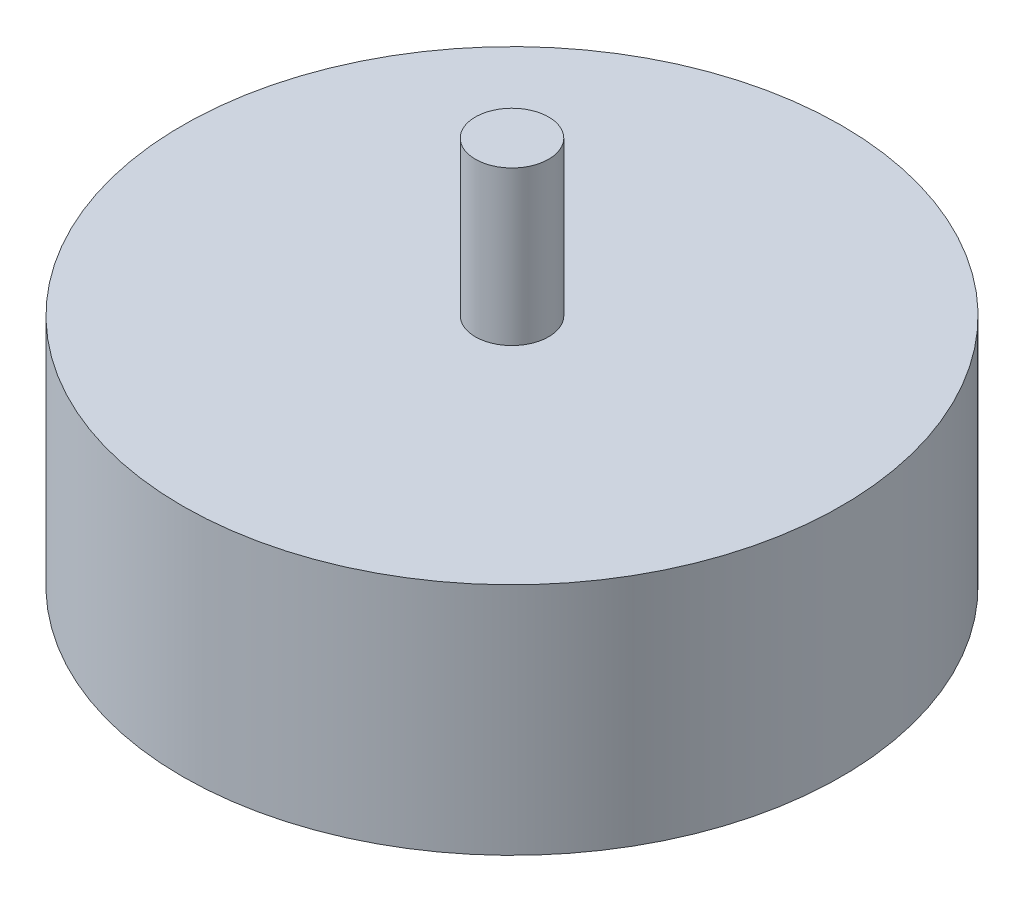
ISO-10303-21;
HEADER;
FILE_DESCRIPTION(('STEP AP214'),'2;1');
FILE_NAME('part.step','',(''),(''),'','','');
FILE_SCHEMA(('AUTOMOTIVE_DESIGN { 1 0 10303 214 1 1 1 1 }'));
ENDSEC;
DATA;
#1=APPLICATION_CONTEXT('core data for automotive mechanical design processes');
#2=APPLICATION_PROTOCOL_DEFINITION('international standard','automotive_design',2000,#1);
#3=PRODUCT_CONTEXT('',#1,'mechanical');
#4=PRODUCT('Part','Part','',(#3));
#5=PRODUCT_RELATED_PRODUCT_CATEGORY('part','',(#4));
#6=PRODUCT_DEFINITION_FORMATION('','',#4);
#7=PRODUCT_DEFINITION_CONTEXT('part definition',#1,'design');
#8=PRODUCT_DEFINITION('design','',#6,#7);
#9=PRODUCT_DEFINITION_SHAPE('','',#8);
#10=(LENGTH_UNIT() NAMED_UNIT(*) SI_UNIT(.MILLI.,.METRE.));
#11=(NAMED_UNIT(*) PLANE_ANGLE_UNIT() SI_UNIT($,.RADIAN.));
#12=(NAMED_UNIT(*) SI_UNIT($,.STERADIAN.) SOLID_ANGLE_UNIT());
#13=UNCERTAINTY_MEASURE_WITH_UNIT(LENGTH_MEASURE(1.E-05),#10,'distance_accuracy_value','');
#14=(GEOMETRIC_REPRESENTATION_CONTEXT(3) GLOBAL_UNCERTAINTY_ASSIGNED_CONTEXT((#13)) GLOBAL_UNIT_ASSIGNED_CONTEXT((#10,
#11,#12)) REPRESENTATION_CONTEXT('',''));
#15=CARTESIAN_POINT('',(0.,0.,0.));
#16=DIRECTION('',(0.,0.,1.));
#17=DIRECTION('',(1.,0.,0.));
#18=AXIS2_PLACEMENT_3D('',#15,#16,#17);
#19=CARTESIAN_POINT('',(0.,12.8,0.));
#20=DIRECTION('',(0.,-1.,0.));
#21=DIRECTION('',(0.,0.,-1.));
#22=AXIS2_PLACEMENT_3D('',#19,#20,#21);
#23=CYLINDRICAL_SURFACE('',#22,18.);
#24=CARTESIAN_POINT('',(0.,12.8,0.));
#25=DIRECTION('',(0.,1.,0.));
#26=DIRECTION('',(0.,0.,1.));
#27=AXIS2_PLACEMENT_3D('',#24,#25,#26);
#28=CIRCLE('',#27,18.);
#29=CARTESIAN_POINT('',(0.,12.8,18.));
#30=VERTEX_POINT('',#29);
#31=EDGE_CURVE('E10',#30,#30,#28,.T.);
#32=ORIENTED_EDGE('',*,*,#31,.F.);
#33=EDGE_LOOP('',(#32));
#34=FACE_BOUND('',#33,.T.);
#35=CARTESIAN_POINT('',(0.,0.,0.));
#36=DIRECTION('',(0.,1.,0.));
#37=DIRECTION('',(0.,0.,1.));
#38=AXIS2_PLACEMENT_3D('',#35,#36,#37);
#39=CIRCLE('',#38,18.);
#40=CARTESIAN_POINT('',(0.,0.,18.));
#41=VERTEX_POINT('',#40);
#42=EDGE_CURVE('E40',#41,#41,#39,.T.);
#43=ORIENTED_EDGE('',*,*,#42,.T.);
#44=EDGE_LOOP('',(#43));
#45=FACE_BOUND('',#44,.T.);
#46=ADVANCED_FACE('F37',(#34,#45),#23,.T.);
#47=CARTESIAN_POINT('',(0.,12.8,0.));
#48=DIRECTION('',(0.,1.,0.));
#49=DIRECTION('',(0.,0.,1.));
#50=AXIS2_PLACEMENT_3D('',#47,#48,#49);
#51=PLANE('',#50);
#52=CARTESIAN_POINT('',(0.,12.8,0.));
#53=DIRECTION('',(0.,1.,0.));
#54=DIRECTION('',(0.,0.,1.));
#55=AXIS2_PLACEMENT_3D('',#52,#53,#54);
#56=CIRCLE('',#55,2.);
#57=CARTESIAN_POINT('',(0.,12.8,2.));
#58=VERTEX_POINT('',#57);
#59=EDGE_CURVE('E49',#58,#58,#56,.F.);
#60=ORIENTED_EDGE('',*,*,#59,.T.);
#61=EDGE_LOOP('',(#60));
#62=FACE_BOUND('',#61,.T.);
#63=ORIENTED_EDGE('',*,*,#31,.T.);
#64=EDGE_LOOP('',(#63));
#65=FACE_BOUND('',#64,.T.);
#66=ADVANCED_FACE('F71',(#62,#65),#51,.T.);
#67=CARTESIAN_POINT('',(0.,0.,0.));
#68=DIRECTION('',(0.,1.,0.));
#69=DIRECTION('',(0.,0.,1.));
#70=AXIS2_PLACEMENT_3D('',#67,#68,#69);
#71=PLANE('',#70);
#72=ORIENTED_EDGE('',*,*,#42,.F.);
#73=EDGE_LOOP('',(#72));
#74=FACE_BOUND('',#73,.T.);
#75=ADVANCED_FACE('F63',(#74),#71,.F.);
#76=CARTESIAN_POINT('',(0.,21.2,0.));
#77=DIRECTION('',(0.,-1.,0.));
#78=DIRECTION('',(0.,0.,-1.));
#79=AXIS2_PLACEMENT_3D('',#76,#77,#78);
#80=CYLINDRICAL_SURFACE('',#79,2.);
#81=ORIENTED_EDGE('',*,*,#59,.F.);
#82=EDGE_LOOP('',(#81));
#83=FACE_BOUND('',#82,.T.);
#84=CARTESIAN_POINT('',(0.,21.2,0.));
#85=DIRECTION('',(0.,1.,0.));
#86=DIRECTION('',(0.,0.,1.));
#87=AXIS2_PLACEMENT_3D('',#84,#85,#86);
#88=CIRCLE('',#87,2.);
#89=CARTESIAN_POINT('',(0.,21.2,2.));
#90=VERTEX_POINT('',#89);
#91=EDGE_CURVE('E54',#90,#90,#88,.T.);
#92=ORIENTED_EDGE('',*,*,#91,.F.);
#93=EDGE_LOOP('',(#92));
#94=FACE_BOUND('',#93,.T.);
#95=ADVANCED_FACE('F61',(#83,#94),#80,.T.);
#96=CARTESIAN_POINT('',(0.,21.2,0.));
#97=DIRECTION('',(0.,1.,0.));
#98=DIRECTION('',(0.,0.,1.));
#99=AXIS2_PLACEMENT_3D('',#96,#97,#98);
#100=PLANE('',#99);
#101=ORIENTED_EDGE('',*,*,#91,.T.);
#102=EDGE_LOOP('',(#101));
#103=FACE_BOUND('',#102,.T.);
#104=ADVANCED_FACE('F59',(#103),#100,.T.);
#105=CLOSED_SHELL('',(#46,#66,#75,#95,#104));
#106=MANIFOLD_SOLID_BREP('B2',#105);
#107=ADVANCED_BREP_SHAPE_REPRESENTATION('',(#18,#106),#14);
#108=SHAPE_DEFINITION_REPRESENTATION(#9,#107);
ENDSEC;
END-ISO-10303-21;
